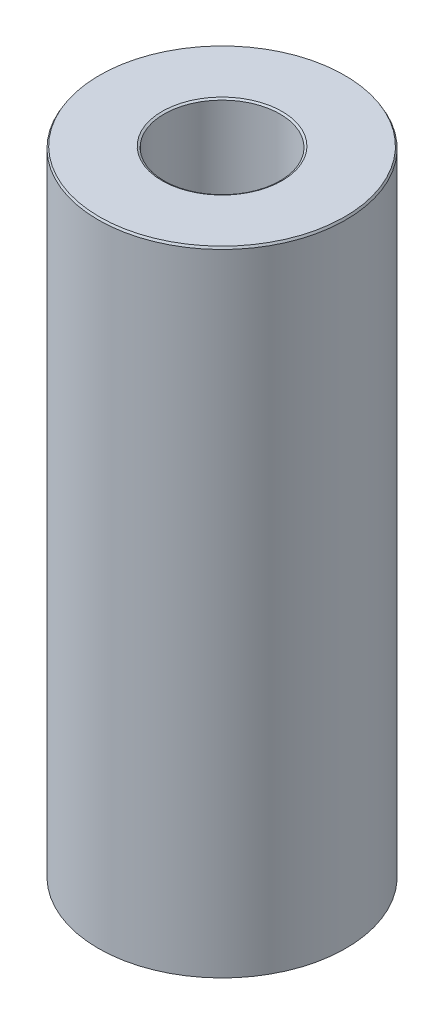
ISO-10303-21;
HEADER;
FILE_DESCRIPTION(('STEP AP214'),'2;1');
FILE_NAME('part.step','',(''),(''),'','','');
FILE_SCHEMA(('AUTOMOTIVE_DESIGN { 1 0 10303 214 1 1 1 1 }'));
ENDSEC;
DATA;
#1=APPLICATION_CONTEXT('core data for automotive mechanical design processes');
#2=APPLICATION_PROTOCOL_DEFINITION('international standard','automotive_design',2000,#1);
#3=PRODUCT_CONTEXT('',#1,'mechanical');
#4=PRODUCT('Part','Part','',(#3));
#5=PRODUCT_RELATED_PRODUCT_CATEGORY('part','',(#4));
#6=PRODUCT_DEFINITION_FORMATION('','',#4);
#7=PRODUCT_DEFINITION_CONTEXT('part definition',#1,'design');
#8=PRODUCT_DEFINITION('design','',#6,#7);
#9=PRODUCT_DEFINITION_SHAPE('','',#8);
#10=(LENGTH_UNIT() NAMED_UNIT(*) SI_UNIT(.MILLI.,.METRE.));
#11=(NAMED_UNIT(*) PLANE_ANGLE_UNIT() SI_UNIT($,.RADIAN.));
#12=(NAMED_UNIT(*) SI_UNIT($,.STERADIAN.) SOLID_ANGLE_UNIT());
#13=UNCERTAINTY_MEASURE_WITH_UNIT(LENGTH_MEASURE(1.E-05),#10,'distance_accuracy_value','');
#14=(GEOMETRIC_REPRESENTATION_CONTEXT(3) GLOBAL_UNCERTAINTY_ASSIGNED_CONTEXT((#13)) GLOBAL_UNIT_ASSIGNED_CONTEXT((#10,
#11,#12)) REPRESENTATION_CONTEXT('',''));
#15=CARTESIAN_POINT('',(0.,0.,0.));
#16=DIRECTION('',(0.,0.,1.));
#17=DIRECTION('',(1.,0.,0.));
#18=AXIS2_PLACEMENT_3D('',#15,#16,#17);
#19=CARTESIAN_POINT('',(0.,294.504761895931,0.));
#20=DIRECTION('',(0.,-1.,0.));
#21=DIRECTION('',(0.,0.,-1.));
#22=AXIS2_PLACEMENT_3D('',#19,#20,#21);
#23=CYLINDRICAL_SURFACE('',#22,57.5);
#24=CARTESIAN_POINT('',(0.,0.55233235793628,0.));
#25=DIRECTION('',(0.,1.,0.));
#26=DIRECTION('',(0.,0.,1.));
#27=AXIS2_PLACEMENT_3D('',#24,#25,#26);
#28=CIRCLE('',#27,57.5);
#29=CARTESIAN_POINT('',(0.,0.55233235793628,57.5));
#30=VERTEX_POINT('',#29);
#31=EDGE_CURVE('E10',#30,#30,#28,.T.);
#32=ORIENTED_EDGE('',*,*,#31,.T.);
#33=EDGE_LOOP('',(#32));
#34=FACE_BOUND('',#33,.T.);
#35=CARTESIAN_POINT('',(0.,293.548094189321,0.));
#36=DIRECTION('',(0.,1.,0.));
#37=DIRECTION('',(0.,0.,1.));
#38=AXIS2_PLACEMENT_3D('',#35,#36,#37);
#39=CIRCLE('',#38,57.5);
#40=CARTESIAN_POINT('',(0.,293.548094189321,57.5));
#41=VERTEX_POINT('',#40);
#42=EDGE_CURVE('E50',#41,#41,#39,.F.);
#43=ORIENTED_EDGE('',*,*,#42,.T.);
#44=EDGE_LOOP('',(#43));
#45=FACE_BOUND('',#44,.T.);
#46=ADVANCED_FACE('F39',(#34,#45),#23,.T.);
#47=CARTESIAN_POINT('',(0.,294.504761895931,0.));
#48=DIRECTION('',(0.,1.,0.));
#49=DIRECTION('',(0.,0.,1.));
#50=AXIS2_PLACEMENT_3D('',#47,#48,#49);
#51=PLANE('',#50);
#52=CARTESIAN_POINT('',(0.,294.504761895931,0.));
#53=DIRECTION('',(0.,1.,0.));
#54=DIRECTION('',(0.,0.,1.));
#55=AXIS2_PLACEMENT_3D('',#52,#53,#54);
#56=CIRCLE('',#55,27.8818214163004);
#57=CARTESIAN_POINT('',(0.,294.504761895931,27.8818214163004));
#58=VERTEX_POINT('',#57);
#59=EDGE_CURVE('E58',#58,#58,#56,.F.);
#60=ORIENTED_EDGE('',*,*,#59,.T.);
#61=EDGE_LOOP('',(#60));
#62=FACE_BOUND('',#61,.T.);
#63=CARTESIAN_POINT('',(0.,294.504761895931,0.));
#64=DIRECTION('',(0.,1.,0.));
#65=DIRECTION('',(0.,0.,1.));
#66=AXIS2_PLACEMENT_3D('',#63,#64,#65);
#67=CIRCLE('',#66,56.9476676420637);
#68=CARTESIAN_POINT('',(0.,294.504761895931,56.9476676420637));
#69=VERTEX_POINT('',#68);
#70=EDGE_CURVE('E61',#69,#69,#67,.T.);
#71=ORIENTED_EDGE('',*,*,#70,.T.);
#72=EDGE_LOOP('',(#71));
#73=FACE_BOUND('',#72,.T.);
#74=ADVANCED_FACE('F88',(#62,#73),#51,.T.);
#75=CARTESIAN_POINT('',(0.,0.,0.));
#76=DIRECTION('',(0.,1.,0.));
#77=DIRECTION('',(0.,0.,1.));
#78=AXIS2_PLACEMENT_3D('',#75,#76,#77);
#79=PLANE('',#78);
#80=CARTESIAN_POINT('',(0.,0.,0.));
#81=DIRECTION('',(0.,1.,0.));
#82=DIRECTION('',(0.,0.,1.));
#83=AXIS2_PLACEMENT_3D('',#80,#81,#82);
#84=CIRCLE('',#83,27.4774860676268);
#85=CARTESIAN_POINT('',(0.,0.,27.4774860676268));
#86=VERTEX_POINT('',#85);
#87=EDGE_CURVE('E51',#86,#86,#84,.T.);
#88=ORIENTED_EDGE('',*,*,#87,.T.);
#89=EDGE_LOOP('',(#88));
#90=FACE_BOUND('',#89,.T.);
#91=CARTESIAN_POINT('',(0.,0.,0.));
#92=DIRECTION('',(0.,1.,0.));
#93=DIRECTION('',(0.,0.,1.));
#94=AXIS2_PLACEMENT_3D('',#91,#92,#93);
#95=CIRCLE('',#94,56.54333229339);
#96=CARTESIAN_POINT('',(0.,0.,56.54333229339));
#97=VERTEX_POINT('',#96);
#98=EDGE_CURVE('E54',#97,#97,#95,.F.);
#99=ORIENTED_EDGE('',*,*,#98,.T.);
#100=EDGE_LOOP('',(#99));
#101=FACE_BOUND('',#100,.T.);
#102=ADVANCED_FACE('F83',(#90,#101),#79,.F.);
#103=CARTESIAN_POINT('',(0.,294.504761895931,0.));
#104=DIRECTION('',(0.,-1.,0.));
#105=DIRECTION('',(0.,0.,-1.));
#106=AXIS2_PLACEMENT_3D('',#103,#104,#105);
#107=CYLINDRICAL_SURFACE('',#106,26.9251537096906);
#108=CARTESIAN_POINT('',(0.,293.952429537995,0.));
#109=DIRECTION('',(0.,1.,0.));
#110=DIRECTION('',(0.,0.,1.));
#111=AXIS2_PLACEMENT_3D('',#108,#109,#110);
#112=CIRCLE('',#111,26.9251537096906);
#113=CARTESIAN_POINT('',(0.,293.952429537995,26.9251537096906));
#114=VERTEX_POINT('',#113);
#115=EDGE_CURVE('E67',#114,#114,#112,.T.);
#116=ORIENTED_EDGE('',*,*,#115,.T.);
#117=EDGE_LOOP('',(#116));
#118=FACE_BOUND('',#117,.T.);
#119=CARTESIAN_POINT('',(0.,0.956667706609904,0.));
#120=DIRECTION('',(0.,1.,0.));
#121=DIRECTION('',(0.,0.,1.));
#122=AXIS2_PLACEMENT_3D('',#119,#120,#121);
#123=CIRCLE('',#122,26.9251537096906);
#124=CARTESIAN_POINT('',(0.,0.956667706609904,26.9251537096906));
#125=VERTEX_POINT('',#124);
#126=EDGE_CURVE('E69',#125,#125,#123,.F.);
#127=ORIENTED_EDGE('',*,*,#126,.T.);
#128=EDGE_LOOP('',(#127));
#129=FACE_BOUND('',#128,.T.);
#130=ADVANCED_FACE('F71',(#118,#129),#107,.F.);
#131=CARTESIAN_POINT('',(0.,293.952429537995,0.));
#132=DIRECTION('',(0.,1.,0.));
#133=DIRECTION('',(0.,0.,1.));
#134=AXIS2_PLACEMENT_3D('',#131,#132,#133);
#135=CONICAL_SURFACE('',#134,26.9251537096906,1.04719755119655);
#136=ORIENTED_EDGE('',*,*,#59,.F.);
#137=EDGE_LOOP('',(#136));
#138=FACE_BOUND('',#137,.T.);
#139=ORIENTED_EDGE('',*,*,#115,.F.);
#140=EDGE_LOOP('',(#139));
#141=FACE_BOUND('',#140,.T.);
#142=ADVANCED_FACE('F77',(#138,#141),#135,.F.);
#143=CARTESIAN_POINT('',(0.,0.,0.));
#144=DIRECTION('',(0.,-1.,0.));
#145=DIRECTION('',(0.,0.,-1.));
#146=AXIS2_PLACEMENT_3D('',#143,#144,#145);
#147=CONICAL_SURFACE('',#146,27.4774860676268,0.523598775598296);
#148=ORIENTED_EDGE('',*,*,#126,.F.);
#149=EDGE_LOOP('',(#148));
#150=FACE_BOUND('',#149,.T.);
#151=ORIENTED_EDGE('',*,*,#87,.F.);
#152=EDGE_LOOP('',(#151));
#153=FACE_BOUND('',#152,.T.);
#154=ADVANCED_FACE('F73',(#150,#153),#147,.F.);
#155=CARTESIAN_POINT('',(0.,0.55233235793628,0.));
#156=DIRECTION('',(0.,1.,0.));
#157=DIRECTION('',(0.,0.,1.));
#158=AXIS2_PLACEMENT_3D('',#155,#156,#157);
#159=CONICAL_SURFACE('',#158,57.5,1.04719755119661);
#160=ORIENTED_EDGE('',*,*,#98,.F.);
#161=EDGE_LOOP('',(#160));
#162=FACE_BOUND('',#161,.T.);
#163=ORIENTED_EDGE('',*,*,#31,.F.);
#164=EDGE_LOOP('',(#163));
#165=FACE_BOUND('',#164,.T.);
#166=ADVANCED_FACE('F76',(#162,#165),#159,.T.);
#167=CARTESIAN_POINT('',(0.,294.504761895931,0.));
#168=DIRECTION('',(0.,-1.,0.));
#169=DIRECTION('',(0.,0.,-1.));
#170=AXIS2_PLACEMENT_3D('',#167,#168,#169);
#171=CONICAL_SURFACE('',#170,56.9476676420637,0.523598775598281);
#172=ORIENTED_EDGE('',*,*,#42,.F.);
#173=EDGE_LOOP('',(#172));
#174=FACE_BOUND('',#173,.T.);
#175=ORIENTED_EDGE('',*,*,#70,.F.);
#176=EDGE_LOOP('',(#175));
#177=FACE_BOUND('',#176,.T.);
#178=ADVANCED_FACE('F45',(#174,#177),#171,.T.);
#179=CLOSED_SHELL('',(#46,#74,#102,#130,#142,#154,#166,#178));
#180=MANIFOLD_SOLID_BREP('B2',#179);
#181=ADVANCED_BREP_SHAPE_REPRESENTATION('',(#18,#180),#14);
#182=SHAPE_DEFINITION_REPRESENTATION(#9,#181);
ENDSEC;
END-ISO-10303-21;
